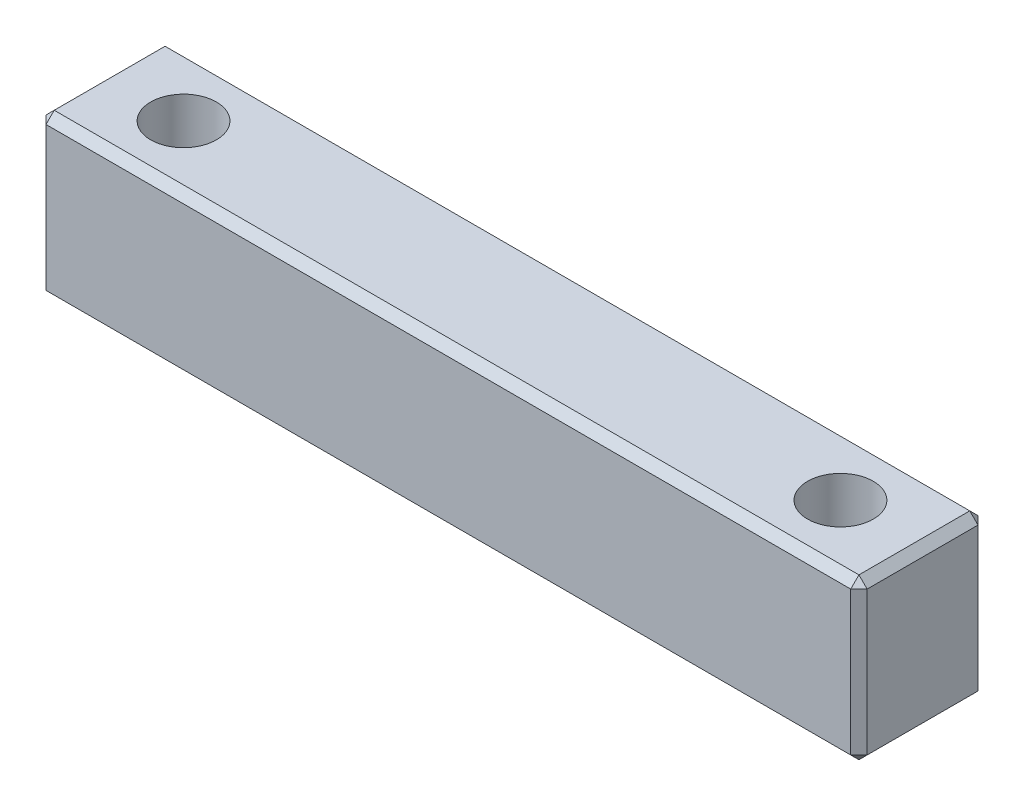
ISO-10303-21;
HEADER;
FILE_DESCRIPTION(('STEP AP214'),'2;1');
FILE_NAME('part.step','',(''),(''),'','','');
FILE_SCHEMA(('AUTOMOTIVE_DESIGN { 1 0 10303 214 1 1 1 1 }'));
ENDSEC;
DATA;
#1=APPLICATION_CONTEXT('core data for automotive mechanical design processes');
#2=APPLICATION_PROTOCOL_DEFINITION('international standard','automotive_design',2000,#1);
#3=PRODUCT_CONTEXT('',#1,'mechanical');
#4=PRODUCT('Part','Part','',(#3));
#5=PRODUCT_RELATED_PRODUCT_CATEGORY('part','',(#4));
#6=PRODUCT_DEFINITION_FORMATION('','',#4);
#7=PRODUCT_DEFINITION_CONTEXT('part definition',#1,'design');
#8=PRODUCT_DEFINITION('design','',#6,#7);
#9=PRODUCT_DEFINITION_SHAPE('','',#8);
#10=(LENGTH_UNIT() NAMED_UNIT(*) SI_UNIT(.MILLI.,.METRE.));
#11=(NAMED_UNIT(*) PLANE_ANGLE_UNIT() SI_UNIT($,.RADIAN.));
#12=(NAMED_UNIT(*) SI_UNIT($,.STERADIAN.) SOLID_ANGLE_UNIT());
#13=UNCERTAINTY_MEASURE_WITH_UNIT(LENGTH_MEASURE(1.E-05),#10,'distance_accuracy_value','');
#14=(GEOMETRIC_REPRESENTATION_CONTEXT(3) GLOBAL_UNCERTAINTY_ASSIGNED_CONTEXT((#13)) GLOBAL_UNIT_ASSIGNED_CONTEXT((#10,
#11,#12)) REPRESENTATION_CONTEXT('',''));
#15=CARTESIAN_POINT('',(0.,0.,0.));
#16=DIRECTION('',(0.,0.,1.));
#17=DIRECTION('',(1.,0.,0.));
#18=AXIS2_PLACEMENT_3D('',#15,#16,#17);
#19=CARTESIAN_POINT('',(50.,0.,0.));
#20=DIRECTION('',(0.,0.,-1.));
#21=DIRECTION('',(0.,1.,0.));
#22=AXIS2_PLACEMENT_3D('',#19,#20,#21);
#23=PLANE('',#22);
#24=DIRECTION('',(0.,1.,0.));
#25=VECTOR('',#24,1.);
#26=CARTESIAN_POINT('',(49.5,0.,0.));
#27=LINE('',#26,#25);
#28=CARTESIAN_POINT('',(49.5,0.5,0.));
#29=VERTEX_POINT('',#28);
#30=CARTESIAN_POINT('',(49.5,9.25,0.));
#31=VERTEX_POINT('',#30);
#32=EDGE_CURVE('E281',#29,#31,#27,.T.);
#33=ORIENTED_EDGE('',*,*,#32,.T.);
#34=DIRECTION('',(-1.,0.,0.));
#35=VECTOR('',#34,1.);
#36=CARTESIAN_POINT('',(50.,9.25,0.));
#37=LINE('',#36,#35);
#38=CARTESIAN_POINT('',(0.5,9.25,0.));
#39=VERTEX_POINT('',#38);
#40=EDGE_CURVE('E290',#31,#39,#37,.T.);
#41=ORIENTED_EDGE('',*,*,#40,.T.);
#42=DIRECTION('',(0.,-1.,0.));
#43=VECTOR('',#42,1.);
#44=CARTESIAN_POINT('',(0.5,0.,0.));
#45=LINE('',#44,#43);
#46=CARTESIAN_POINT('',(0.5,0.5,0.));
#47=VERTEX_POINT('',#46);
#48=EDGE_CURVE('E287',#39,#47,#45,.T.);
#49=ORIENTED_EDGE('',*,*,#48,.T.);
#50=DIRECTION('',(1.,0.,0.));
#51=VECTOR('',#50,1.);
#52=CARTESIAN_POINT('',(50.,0.5,0.));
#53=LINE('',#52,#51);
#54=EDGE_CURVE('E284',#47,#29,#53,.T.);
#55=ORIENTED_EDGE('',*,*,#54,.T.);
#56=EDGE_LOOP('',(#33,#41,#49,#55));
#57=FACE_BOUND('',#56,.T.);
#58=ADVANCED_FACE('F41',(#57),#23,.F.);
#59=CARTESIAN_POINT('',(50.,0.,0.));
#60=DIRECTION('',(0.,1.,0.));
#61=DIRECTION('',(0.,0.,1.));
#62=AXIS2_PLACEMENT_3D('',#59,#60,#61);
#63=PLANE('',#62);
#64=DIRECTION('',(-1.,0.,0.));
#65=VECTOR('',#64,1.);
#66=CARTESIAN_POINT('',(50.,0.,-0.499999999999993));
#67=LINE('',#66,#65);
#68=CARTESIAN_POINT('',(49.5,0.,-0.499999999999993));
#69=VERTEX_POINT('',#68);
#70=CARTESIAN_POINT('',(0.499999999999994,0.,-0.499999999999993));
#71=VERTEX_POINT('',#70);
#72=EDGE_CURVE('E143',#69,#71,#67,.T.);
#73=ORIENTED_EDGE('',*,*,#72,.T.);
#74=DIRECTION('',(0.,0.,-1.));
#75=VECTOR('',#74,1.);
#76=CARTESIAN_POINT('',(0.499999999999994,0.,-7.75000000000001));
#77=LINE('',#76,#75);
#78=CARTESIAN_POINT('',(0.499999999999994,0.,-7.25));
#79=VERTEX_POINT('',#78);
#80=EDGE_CURVE('E138',#71,#79,#77,.T.);
#81=ORIENTED_EDGE('',*,*,#80,.T.);
#82=DIRECTION('',(1.,0.,0.));
#83=VECTOR('',#82,1.);
#84=CARTESIAN_POINT('',(50.,0.,-7.25));
#85=LINE('',#84,#83);
#86=CARTESIAN_POINT('',(49.5,0.,-7.25));
#87=VERTEX_POINT('',#86);
#88=EDGE_CURVE('E131',#79,#87,#85,.T.);
#89=ORIENTED_EDGE('',*,*,#88,.T.);
#90=DIRECTION('',(0.,0.,1.));
#91=VECTOR('',#90,1.);
#92=CARTESIAN_POINT('',(49.5,0.,0.));
#93=LINE('',#92,#91);
#94=EDGE_CURVE('E135',#87,#69,#93,.T.);
#95=ORIENTED_EDGE('',*,*,#94,.T.);
#96=EDGE_LOOP('',(#73,#81,#89,#95));
#97=FACE_BOUND('',#96,.T.);
#98=CARTESIAN_POINT('',(5.,0.,-3.875));
#99=DIRECTION('',(0.,1.,0.));
#100=DIRECTION('',(0.,0.,1.));
#101=AXIS2_PLACEMENT_3D('',#98,#99,#100);
#102=CIRCLE('',#101,2.);
#103=CARTESIAN_POINT('',(5.,0.,-1.875));
#104=VERTEX_POINT('',#103);
#105=EDGE_CURVE('E155',#104,#104,#102,.F.);
#106=ORIENTED_EDGE('',*,*,#105,.F.);
#107=EDGE_LOOP('',(#106));
#108=FACE_BOUND('',#107,.T.);
#109=CARTESIAN_POINT('',(45.,0.,-3.875));
#110=DIRECTION('',(0.,1.,0.));
#111=DIRECTION('',(0.,0.,1.));
#112=AXIS2_PLACEMENT_3D('',#109,#110,#111);
#113=CIRCLE('',#112,2.);
#114=CARTESIAN_POINT('',(45.,0.,-1.875));
#115=VERTEX_POINT('',#114);
#116=EDGE_CURVE('E240',#115,#115,#113,.F.);
#117=ORIENTED_EDGE('',*,*,#116,.F.);
#118=EDGE_LOOP('',(#117));
#119=FACE_BOUND('',#118,.T.);
#120=ADVANCED_FACE('F133',(#97,#108,#119),#63,.F.);
#121=CARTESIAN_POINT('',(50.,0.,-7.75000000000001));
#122=DIRECTION('',(0.,0.,1.));
#123=DIRECTION('',(0.,-1.,0.));
#124=AXIS2_PLACEMENT_3D('',#121,#122,#123);
#125=PLANE('',#124);
#126=DIRECTION('',(0.,-1.,0.));
#127=VECTOR('',#126,1.);
#128=CARTESIAN_POINT('',(49.5,0.,-7.75000000000001));
#129=LINE('',#128,#127);
#130=CARTESIAN_POINT('',(49.5,9.25,-7.75));
#131=VERTEX_POINT('',#130);
#132=CARTESIAN_POINT('',(49.5,0.499999999999994,-7.75000000000001));
#133=VERTEX_POINT('',#132);
#134=EDGE_CURVE('E294',#131,#133,#129,.T.);
#135=ORIENTED_EDGE('',*,*,#134,.T.);
#136=DIRECTION('',(-1.,0.,0.));
#137=VECTOR('',#136,1.);
#138=CARTESIAN_POINT('',(50.,0.499999999999994,-7.75000000000001));
#139=LINE('',#138,#137);
#140=CARTESIAN_POINT('',(0.499999999999994,0.499999999999994,-7.75000000000001));
#141=VERTEX_POINT('',#140);
#142=EDGE_CURVE('E168',#133,#141,#139,.T.);
#143=ORIENTED_EDGE('',*,*,#142,.T.);
#144=DIRECTION('',(0.,1.,0.));
#145=VECTOR('',#144,1.);
#146=CARTESIAN_POINT('',(0.499999999999994,9.75,-7.75));
#147=LINE('',#146,#145);
#148=CARTESIAN_POINT('',(0.499999999999994,9.25,-7.75));
#149=VERTEX_POINT('',#148);
#150=EDGE_CURVE('E300',#141,#149,#147,.T.);
#151=ORIENTED_EDGE('',*,*,#150,.T.);
#152=DIRECTION('',(1.,0.,0.));
#153=VECTOR('',#152,1.);
#154=CARTESIAN_POINT('',(50.,9.25,-7.75));
#155=LINE('',#154,#153);
#156=EDGE_CURVE('E297',#149,#131,#155,.T.);
#157=ORIENTED_EDGE('',*,*,#156,.T.);
#158=EDGE_LOOP('',(#135,#143,#151,#157));
#159=FACE_BOUND('',#158,.T.);
#160=ADVANCED_FACE('F356',(#159),#125,.F.);
#161=CARTESIAN_POINT('',(50.,9.75,0.));
#162=DIRECTION('',(0.,-1.,0.));
#163=DIRECTION('',(0.,0.,-1.));
#164=AXIS2_PLACEMENT_3D('',#161,#162,#163);
#165=PLANE('',#164);
#166=DIRECTION('',(-1.,0.,0.));
#167=VECTOR('',#166,1.);
#168=CARTESIAN_POINT('',(50.,9.75,-7.25));
#169=LINE('',#168,#167);
#170=CARTESIAN_POINT('',(49.5,9.75,-7.25));
#171=VERTEX_POINT('',#170);
#172=CARTESIAN_POINT('',(0.499999999999994,9.75,-7.25));
#173=VERTEX_POINT('',#172);
#174=EDGE_CURVE('E271',#171,#173,#169,.T.);
#175=ORIENTED_EDGE('',*,*,#174,.T.);
#176=DIRECTION('',(0.,0.,1.));
#177=VECTOR('',#176,1.);
#178=CARTESIAN_POINT('',(0.499999999999994,9.75,0.));
#179=LINE('',#178,#177);
#180=CARTESIAN_POINT('',(0.499999999999994,9.75,-0.499999999999987));
#181=VERTEX_POINT('',#180);
#182=EDGE_CURVE('E277',#173,#181,#179,.T.);
#183=ORIENTED_EDGE('',*,*,#182,.T.);
#184=DIRECTION('',(1.,0.,0.));
#185=VECTOR('',#184,1.);
#186=CARTESIAN_POINT('',(50.,9.75,-0.499999999999987));
#187=LINE('',#186,#185);
#188=CARTESIAN_POINT('',(49.5,9.75,-0.499999999999987));
#189=VERTEX_POINT('',#188);
#190=EDGE_CURVE('E274',#181,#189,#187,.T.);
#191=ORIENTED_EDGE('',*,*,#190,.T.);
#192=DIRECTION('',(0.,0.,-1.));
#193=VECTOR('',#192,1.);
#194=CARTESIAN_POINT('',(49.5,9.75,0.));
#195=LINE('',#194,#193);
#196=EDGE_CURVE('E268',#189,#171,#195,.T.);
#197=ORIENTED_EDGE('',*,*,#196,.T.);
#198=EDGE_LOOP('',(#175,#183,#191,#197));
#199=FACE_BOUND('',#198,.T.);
#200=CARTESIAN_POINT('',(5.,9.75,-3.875));
#201=DIRECTION('',(0.,1.,0.));
#202=DIRECTION('',(0.,0.,1.));
#203=AXIS2_PLACEMENT_3D('',#200,#201,#202);
#204=CIRCLE('',#203,2.);
#205=CARTESIAN_POINT('',(5.,9.75,-1.875));
#206=VERTEX_POINT('',#205);
#207=EDGE_CURVE('E246',#206,#206,#204,.T.);
#208=ORIENTED_EDGE('',*,*,#207,.F.);
#209=EDGE_LOOP('',(#208));
#210=FACE_BOUND('',#209,.T.);
#211=CARTESIAN_POINT('',(45.,9.75,-3.875));
#212=DIRECTION('',(0.,1.,0.));
#213=DIRECTION('',(0.,0.,1.));
#214=AXIS2_PLACEMENT_3D('',#211,#212,#213);
#215=CIRCLE('',#214,2.);
#216=CARTESIAN_POINT('',(45.,9.75,-1.875));
#217=VERTEX_POINT('',#216);
#218=EDGE_CURVE('E233',#217,#217,#215,.T.);
#219=ORIENTED_EDGE('',*,*,#218,.F.);
#220=EDGE_LOOP('',(#219));
#221=FACE_BOUND('',#220,.T.);
#222=ADVANCED_FACE('F367',(#199,#210,#221),#165,.F.);
#223=CARTESIAN_POINT('',(50.,0.,0.));
#224=DIRECTION('',(-1.,0.,0.));
#225=DIRECTION('',(0.,0.,1.));
#226=AXIS2_PLACEMENT_3D('',#223,#224,#225);
#227=PLANE('',#226);
#228=DIRECTION('',(0.,1.,0.));
#229=VECTOR('',#228,1.);
#230=CARTESIAN_POINT('',(50.,0.,-7.25000000000001));
#231=LINE('',#230,#229);
#232=CARTESIAN_POINT('',(50.,0.499999999999994,-7.25000000000001));
#233=VERTEX_POINT('',#232);
#234=CARTESIAN_POINT('',(50.,9.25000000000001,-7.25));
#235=VERTEX_POINT('',#234);
#236=EDGE_CURVE('E52',#233,#235,#231,.T.);
#237=ORIENTED_EDGE('',*,*,#236,.T.);
#238=DIRECTION('',(0.,0.,1.));
#239=VECTOR('',#238,1.);
#240=CARTESIAN_POINT('',(50.,9.25000000000001,0.));
#241=LINE('',#240,#239);
#242=CARTESIAN_POINT('',(50.,9.25000000000001,-0.499999999999987));
#243=VERTEX_POINT('',#242);
#244=EDGE_CURVE('E11',#235,#243,#241,.T.);
#245=ORIENTED_EDGE('',*,*,#244,.T.);
#246=DIRECTION('',(0.,-1.,0.));
#247=VECTOR('',#246,1.);
#248=CARTESIAN_POINT('',(50.,0.,-0.499999999999994));
#249=LINE('',#248,#247);
#250=CARTESIAN_POINT('',(50.,0.499999999999994,-0.499999999999993));
#251=VERTEX_POINT('',#250);
#252=EDGE_CURVE('E305',#243,#251,#249,.T.);
#253=ORIENTED_EDGE('',*,*,#252,.T.);
#254=DIRECTION('',(0.,0.,-1.));
#255=VECTOR('',#254,1.);
#256=CARTESIAN_POINT('',(50.,0.499999999999994,0.));
#257=LINE('',#256,#255);
#258=EDGE_CURVE('E63',#251,#233,#257,.T.);
#259=ORIENTED_EDGE('',*,*,#258,.T.);
#260=EDGE_LOOP('',(#237,#245,#253,#259));
#261=FACE_BOUND('',#260,.T.);
#262=ADVANCED_FACE('F381',(#261),#227,.F.);
#263=CARTESIAN_POINT('',(0.,0.,0.));
#264=DIRECTION('',(-1.,0.,0.));
#265=DIRECTION('',(0.,0.,1.));
#266=AXIS2_PLACEMENT_3D('',#263,#264,#265);
#267=PLANE('',#266);
#268=DIRECTION('',(0.,0.,1.));
#269=VECTOR('',#268,1.);
#270=CARTESIAN_POINT('',(0.,0.5,0.));
#271=LINE('',#270,#269);
#272=CARTESIAN_POINT('',(0.,0.5,-7.25));
#273=VERTEX_POINT('',#272);
#274=CARTESIAN_POINT('',(0.,0.5,-0.499999999999993));
#275=VERTEX_POINT('',#274);
#276=EDGE_CURVE('E261',#273,#275,#271,.T.);
#277=ORIENTED_EDGE('',*,*,#276,.T.);
#278=DIRECTION('',(0.,1.,0.));
#279=VECTOR('',#278,1.);
#280=CARTESIAN_POINT('',(0.,9.75,-0.499999999999987));
#281=LINE('',#280,#279);
#282=CARTESIAN_POINT('',(0.,9.25,-0.499999999999987));
#283=VERTEX_POINT('',#282);
#284=EDGE_CURVE('E265',#275,#283,#281,.T.);
#285=ORIENTED_EDGE('',*,*,#284,.T.);
#286=DIRECTION('',(0.,0.,-1.));
#287=VECTOR('',#286,1.);
#288=CARTESIAN_POINT('',(0.,9.25,-7.75));
#289=LINE('',#288,#287);
#290=CARTESIAN_POINT('',(0.,9.25,-7.25));
#291=VERTEX_POINT('',#290);
#292=EDGE_CURVE('E258',#283,#291,#289,.T.);
#293=ORIENTED_EDGE('',*,*,#292,.T.);
#294=DIRECTION('',(0.,-1.,0.));
#295=VECTOR('',#294,1.);
#296=CARTESIAN_POINT('',(0.,0.,-7.25));
#297=LINE('',#296,#295);
#298=EDGE_CURVE('E255',#291,#273,#297,.T.);
#299=ORIENTED_EDGE('',*,*,#298,.T.);
#300=EDGE_LOOP('',(#277,#285,#293,#299));
#301=FACE_BOUND('',#300,.T.);
#302=ADVANCED_FACE('F342',(#301),#267,.T.);
#303=CARTESIAN_POINT('',(45.,-5.65685424949238,-3.875));
#304=DIRECTION('',(0.,1.,0.));
#305=DIRECTION('',(0.,0.,1.));
#306=AXIS2_PLACEMENT_3D('',#303,#304,#305);
#307=CYLINDRICAL_SURFACE('',#306,2.);
#308=ORIENTED_EDGE('',*,*,#116,.T.);
#309=EDGE_LOOP('',(#308));
#310=FACE_BOUND('',#309,.T.);
#311=ORIENTED_EDGE('',*,*,#218,.T.);
#312=EDGE_LOOP('',(#311));
#313=FACE_BOUND('',#312,.T.);
#314=ADVANCED_FACE('F504',(#310,#313),#307,.F.);
#315=CARTESIAN_POINT('',(5.,-5.65685424949238,-3.875));
#316=DIRECTION('',(0.,1.,0.));
#317=DIRECTION('',(0.,0.,1.));
#318=AXIS2_PLACEMENT_3D('',#315,#316,#317);
#319=CYLINDRICAL_SURFACE('',#318,2.);
#320=ORIENTED_EDGE('',*,*,#105,.T.);
#321=EDGE_LOOP('',(#320));
#322=FACE_BOUND('',#321,.T.);
#323=ORIENTED_EDGE('',*,*,#207,.T.);
#324=EDGE_LOOP('',(#323));
#325=FACE_BOUND('',#324,.T.);
#326=ADVANCED_FACE('F500',(#322,#325),#319,.F.);
#327=CARTESIAN_POINT('',(50.,9.25000000000001,0.));
#328=DIRECTION('',(-0.707106781186543,-0.707106781186552,0.));
#329=DIRECTION('',(0.,0.,1.));
#330=AXIS2_PLACEMENT_3D('',#327,#328,#329);
#331=PLANE('',#330);
#332=DIRECTION('',(0.707106781186552,-0.707106781186543,0.));
#333=VECTOR('',#332,1.);
#334=CARTESIAN_POINT('',(49.5,9.75,-0.499999999999987));
#335=LINE('',#334,#333);
#336=EDGE_CURVE('E46',#243,#189,#335,.F.);
#337=ORIENTED_EDGE('',*,*,#336,.F.);
#338=ORIENTED_EDGE('',*,*,#244,.F.);
#339=DIRECTION('',(-0.707106781186552,0.707106781186543,0.));
#340=VECTOR('',#339,1.);
#341=CARTESIAN_POINT('',(49.75,9.5,-7.25));
#342=LINE('',#341,#340);
#343=EDGE_CURVE('E224',#171,#235,#342,.F.);
#344=ORIENTED_EDGE('',*,*,#343,.F.);
#345=ORIENTED_EDGE('',*,*,#196,.F.);
#346=EDGE_LOOP('',(#337,#338,#344,#345));
#347=FACE_BOUND('',#346,.T.);
#348=ADVANCED_FACE('F44',(#347),#331,.F.);
#349=CARTESIAN_POINT('',(49.5,9.75,-0.499999999999987));
#350=DIRECTION('',(0.577350269189618,0.577350269189626,0.577350269189634));
#351=DIRECTION('',(0.,-0.707106781186552,0.707106781186543));
#352=AXIS2_PLACEMENT_3D('',#349,#350,#351);
#353=PLANE('',#352);
#354=DIRECTION('',(-0.707106781186552,0.,0.707106781186543));
#355=VECTOR('',#354,1.);
#356=CARTESIAN_POINT('',(49.75,9.25,-0.24999999999999));
#357=LINE('',#356,#355);
#358=EDGE_CURVE('E217',#243,#31,#357,.T.);
#359=ORIENTED_EDGE('',*,*,#358,.F.);
#360=ORIENTED_EDGE('',*,*,#336,.T.);
#361=DIRECTION('',(0.,0.707106781186552,-0.707106781186543));
#362=VECTOR('',#361,1.);
#363=CARTESIAN_POINT('',(49.5,9.75,-0.499999999999987));
#364=LINE('',#363,#362);
#365=EDGE_CURVE('E221',#31,#189,#364,.T.);
#366=ORIENTED_EDGE('',*,*,#365,.F.);
#367=EDGE_LOOP('',(#359,#360,#366));
#368=FACE_BOUND('',#367,.T.);
#369=ADVANCED_FACE('F492',(#368),#353,.T.);
#370=CARTESIAN_POINT('',(49.5,9.25,-7.75));
#371=DIRECTION('',(0.577350269189618,0.577350269189626,-0.577350269189634));
#372=DIRECTION('',(0.,0.707106781186552,0.707106781186543));
#373=AXIS2_PLACEMENT_3D('',#370,#371,#372);
#374=PLANE('',#373);
#375=DIRECTION('',(0.,-0.707106781186552,-0.707106781186543));
#376=VECTOR('',#375,1.);
#377=CARTESIAN_POINT('',(49.5,9.25,-7.75));
#378=LINE('',#377,#376);
#379=EDGE_CURVE('E209',#171,#131,#378,.T.);
#380=ORIENTED_EDGE('',*,*,#379,.F.);
#381=ORIENTED_EDGE('',*,*,#343,.T.);
#382=DIRECTION('',(0.707106781186552,0.,0.707106781186543));
#383=VECTOR('',#382,1.);
#384=CARTESIAN_POINT('',(49.5,9.25,-7.75));
#385=LINE('',#384,#383);
#386=EDGE_CURVE('E213',#131,#235,#385,.T.);
#387=ORIENTED_EDGE('',*,*,#386,.F.);
#388=EDGE_LOOP('',(#380,#381,#387));
#389=FACE_BOUND('',#388,.T.);
#390=ADVANCED_FACE('F360',(#389),#374,.T.);
#391=CARTESIAN_POINT('',(50.,9.25,0.));
#392=DIRECTION('',(0.,-0.707106781186543,-0.707106781186552));
#393=DIRECTION('',(-1.,0.,0.));
#394=AXIS2_PLACEMENT_3D('',#391,#392,#393);
#395=PLANE('',#394);
#396=ORIENTED_EDGE('',*,*,#365,.T.);
#397=ORIENTED_EDGE('',*,*,#190,.F.);
#398=DIRECTION('',(0.,-0.707106781186552,0.707106781186543));
#399=VECTOR('',#398,1.);
#400=CARTESIAN_POINT('',(0.499999999999994,9.75,-0.499999999999987));
#401=LINE('',#400,#399);
#402=EDGE_CURVE('E202',#39,#181,#401,.F.);
#403=ORIENTED_EDGE('',*,*,#402,.F.);
#404=ORIENTED_EDGE('',*,*,#40,.F.);
#405=EDGE_LOOP('',(#396,#397,#403,#404));
#406=FACE_BOUND('',#405,.T.);
#407=ADVANCED_FACE('F378',(#406),#395,.F.);
#408=CARTESIAN_POINT('',(50.,0.,-0.499999999999994));
#409=DIRECTION('',(-0.707106781186543,0.,-0.707106781186552));
#410=DIRECTION('',(0.,-1.,0.));
#411=AXIS2_PLACEMENT_3D('',#408,#409,#410);
#412=PLANE('',#411);
#413=ORIENTED_EDGE('',*,*,#358,.T.);
#414=ORIENTED_EDGE('',*,*,#32,.F.);
#415=DIRECTION('',(0.707106781186552,0.,-0.707106781186543));
#416=VECTOR('',#415,1.);
#417=CARTESIAN_POINT('',(49.5,0.5,0.));
#418=LINE('',#417,#416);
#419=EDGE_CURVE('E198',#251,#29,#418,.F.);
#420=ORIENTED_EDGE('',*,*,#419,.F.);
#421=ORIENTED_EDGE('',*,*,#252,.F.);
#422=EDGE_LOOP('',(#413,#414,#420,#421));
#423=FACE_BOUND('',#422,.T.);
#424=ADVANCED_FACE('F385',(#423),#412,.F.);
#425=CARTESIAN_POINT('',(50.,0.499999999999994,0.));
#426=DIRECTION('',(-0.707106781186543,0.707106781186552,0.));
#427=DIRECTION('',(0.,0.,-1.));
#428=AXIS2_PLACEMENT_3D('',#425,#426,#427);
#429=PLANE('',#428);
#430=DIRECTION('',(0.707106781186552,0.707106781186543,0.));
#431=VECTOR('',#430,1.);
#432=CARTESIAN_POINT('',(49.5,0.,-7.25));
#433=LINE('',#432,#431);
#434=EDGE_CURVE('E149',#233,#87,#433,.F.);
#435=ORIENTED_EDGE('',*,*,#434,.F.);
#436=ORIENTED_EDGE('',*,*,#258,.F.);
#437=DIRECTION('',(-0.707106781186552,-0.707106781186543,0.));
#438=VECTOR('',#437,1.);
#439=CARTESIAN_POINT('',(49.75,0.249999999999997,-0.499999999999993));
#440=LINE('',#439,#438);
#441=EDGE_CURVE('E152',#69,#251,#440,.F.);
#442=ORIENTED_EDGE('',*,*,#441,.F.);
#443=ORIENTED_EDGE('',*,*,#94,.F.);
#444=EDGE_LOOP('',(#435,#436,#442,#443));
#445=FACE_BOUND('',#444,.T.);
#446=ADVANCED_FACE('F148',(#445),#429,.F.);
#447=CARTESIAN_POINT('',(50.,0.,-7.25000000000001));
#448=DIRECTION('',(-0.707106781186543,0.,0.707106781186552));
#449=DIRECTION('',(0.,1.,0.));
#450=AXIS2_PLACEMENT_3D('',#447,#448,#449);
#451=PLANE('',#450);
#452=ORIENTED_EDGE('',*,*,#386,.T.);
#453=ORIENTED_EDGE('',*,*,#236,.F.);
#454=DIRECTION('',(-0.707106781186552,0.,-0.707106781186543));
#455=VECTOR('',#454,1.);
#456=CARTESIAN_POINT('',(49.75,0.499999999999993,-7.50000000000001));
#457=LINE('',#456,#455);
#458=EDGE_CURVE('E163',#133,#233,#457,.F.);
#459=ORIENTED_EDGE('',*,*,#458,.F.);
#460=ORIENTED_EDGE('',*,*,#134,.F.);
#461=EDGE_LOOP('',(#452,#453,#459,#460));
#462=FACE_BOUND('',#461,.T.);
#463=ADVANCED_FACE('F359',(#462),#451,.F.);
#464=CARTESIAN_POINT('',(50.,9.75,-7.25));
#465=DIRECTION('',(0.,-0.707106781186543,0.707106781186552));
#466=DIRECTION('',(-1.,0.,0.));
#467=AXIS2_PLACEMENT_3D('',#464,#465,#466);
#468=PLANE('',#467);
#469=ORIENTED_EDGE('',*,*,#379,.T.);
#470=ORIENTED_EDGE('',*,*,#156,.F.);
#471=DIRECTION('',(0.,0.707106781186552,0.707106781186543));
#472=VECTOR('',#471,1.);
#473=CARTESIAN_POINT('',(0.499999999999994,9.5,-7.5));
#474=LINE('',#473,#472);
#475=EDGE_CURVE('E190',#173,#149,#474,.F.);
#476=ORIENTED_EDGE('',*,*,#475,.F.);
#477=ORIENTED_EDGE('',*,*,#174,.F.);
#478=EDGE_LOOP('',(#469,#470,#476,#477));
#479=FACE_BOUND('',#478,.T.);
#480=ADVANCED_FACE('F364',(#479),#468,.F.);
#481=CARTESIAN_POINT('',(0.499999999999994,9.75,0.));
#482=DIRECTION('',(-0.707106781186552,0.707106781186543,0.));
#483=DIRECTION('',(0.,0.,-1.));
#484=AXIS2_PLACEMENT_3D('',#481,#482,#483);
#485=PLANE('',#484);
#486=DIRECTION('',(-0.707106781186543,-0.707106781186552,0.));
#487=VECTOR('',#486,1.);
#488=CARTESIAN_POINT('',(0.499999999999994,9.75,-0.499999999999987));
#489=LINE('',#488,#487);
#490=EDGE_CURVE('E205',#181,#283,#489,.T.);
#491=ORIENTED_EDGE('',*,*,#490,.F.);
#492=ORIENTED_EDGE('',*,*,#182,.F.);
#493=DIRECTION('',(0.707106781186543,0.707106781186552,0.));
#494=VECTOR('',#493,1.);
#495=CARTESIAN_POINT('',(0.,9.25,-7.25));
#496=LINE('',#495,#494);
#497=EDGE_CURVE('E186',#291,#173,#496,.T.);
#498=ORIENTED_EDGE('',*,*,#497,.F.);
#499=ORIENTED_EDGE('',*,*,#292,.F.);
#500=EDGE_LOOP('',(#491,#492,#498,#499));
#501=FACE_BOUND('',#500,.T.);
#502=ADVANCED_FACE('F373',(#501),#485,.T.);
#503=CARTESIAN_POINT('',(0.499999999999994,9.75,-0.499999999999987));
#504=DIRECTION('',(-0.577350269189626,0.577350269189618,0.577350269189634));
#505=DIRECTION('',(0.707106781186552,0.,0.707106781186543));
#506=AXIS2_PLACEMENT_3D('',#503,#504,#505);
#507=PLANE('',#506);
#508=ORIENTED_EDGE('',*,*,#402,.T.);
#509=ORIENTED_EDGE('',*,*,#490,.T.);
#510=DIRECTION('',(0.707106781186552,0.,0.707106781186543));
#511=VECTOR('',#510,1.);
#512=CARTESIAN_POINT('',(0.25,9.25,-0.24999999999999));
#513=LINE('',#512,#511);
#514=EDGE_CURVE('E176',#39,#283,#513,.F.);
#515=ORIENTED_EDGE('',*,*,#514,.F.);
#516=EDGE_LOOP('',(#508,#509,#515));
#517=FACE_BOUND('',#516,.T.);
#518=ADVANCED_FACE('F393',(#517),#507,.T.);
#519=CARTESIAN_POINT('',(49.5,0.5,0.));
#520=DIRECTION('',(0.577350269189618,-0.577350269189626,0.577350269189634));
#521=DIRECTION('',(0.,-0.707106781186552,-0.707106781186543));
#522=AXIS2_PLACEMENT_3D('',#519,#520,#521);
#523=PLANE('',#522);
#524=ORIENTED_EDGE('',*,*,#441,.T.);
#525=ORIENTED_EDGE('',*,*,#419,.T.);
#526=DIRECTION('',(0.,0.707106781186552,0.707106781186543));
#527=VECTOR('',#526,1.);
#528=CARTESIAN_POINT('',(49.5,0.5,0.));
#529=LINE('',#528,#527);
#530=EDGE_CURVE('E170',#69,#29,#529,.T.);
#531=ORIENTED_EDGE('',*,*,#530,.F.);
#532=EDGE_LOOP('',(#524,#525,#531));
#533=FACE_BOUND('',#532,.T.);
#534=ADVANCED_FACE('F387',(#533),#523,.T.);
#535=CARTESIAN_POINT('',(49.5,0.,-7.25));
#536=DIRECTION('',(0.577350269189618,-0.577350269189634,-0.577350269189626));
#537=DIRECTION('',(0.,0.707106781186543,-0.707106781186552));
#538=AXIS2_PLACEMENT_3D('',#535,#536,#537);
#539=PLANE('',#538);
#540=ORIENTED_EDGE('',*,*,#458,.T.);
#541=ORIENTED_EDGE('',*,*,#434,.T.);
#542=DIRECTION('',(0.,-0.707106781186543,0.707106781186552));
#543=VECTOR('',#542,1.);
#544=CARTESIAN_POINT('',(49.5,0.,-7.25));
#545=LINE('',#544,#543);
#546=EDGE_CURVE('E160',#133,#87,#545,.T.);
#547=ORIENTED_EDGE('',*,*,#546,.F.);
#548=EDGE_LOOP('',(#540,#541,#547));
#549=FACE_BOUND('',#548,.T.);
#550=ADVANCED_FACE('F159',(#549),#539,.T.);
#551=CARTESIAN_POINT('',(0.,9.25,-7.25));
#552=DIRECTION('',(-0.577350269189634,0.577350269189618,-0.577350269189626));
#553=DIRECTION('',(-0.707106781186543,0.,0.707106781186552));
#554=AXIS2_PLACEMENT_3D('',#551,#552,#553);
#555=PLANE('',#554);
#556=ORIENTED_EDGE('',*,*,#497,.T.);
#557=ORIENTED_EDGE('',*,*,#475,.T.);
#558=DIRECTION('',(-0.707106781186543,0.,0.707106781186552));
#559=VECTOR('',#558,1.);
#560=CARTESIAN_POINT('',(0.,9.25,-7.25));
#561=LINE('',#560,#559);
#562=EDGE_CURVE('E171',#291,#149,#561,.F.);
#563=ORIENTED_EDGE('',*,*,#562,.F.);
#564=EDGE_LOOP('',(#556,#557,#563));
#565=FACE_BOUND('',#564,.T.);
#566=ADVANCED_FACE('F447',(#565),#555,.T.);
#567=CARTESIAN_POINT('',(0.5,0.,0.));
#568=DIRECTION('',(-0.707106781186543,0.,0.707106781186552));
#569=DIRECTION('',(0.,1.,0.));
#570=AXIS2_PLACEMENT_3D('',#567,#568,#569);
#571=PLANE('',#570);
#572=ORIENTED_EDGE('',*,*,#514,.T.);
#573=ORIENTED_EDGE('',*,*,#284,.F.);
#574=DIRECTION('',(-0.707106781186552,0.,-0.707106781186543));
#575=VECTOR('',#574,1.);
#576=CARTESIAN_POINT('',(0.,0.5,-0.499999999999993));
#577=LINE('',#576,#575);
#578=EDGE_CURVE('E179',#47,#275,#577,.T.);
#579=ORIENTED_EDGE('',*,*,#578,.F.);
#580=ORIENTED_EDGE('',*,*,#48,.F.);
#581=EDGE_LOOP('',(#572,#573,#579,#580));
#582=FACE_BOUND('',#581,.T.);
#583=ADVANCED_FACE('F337',(#582),#571,.T.);
#584=CARTESIAN_POINT('',(50.,0.,-0.499999999999993));
#585=DIRECTION('',(0.,0.707106781186543,-0.707106781186552));
#586=DIRECTION('',(-1.,0.,0.));
#587=AXIS2_PLACEMENT_3D('',#584,#585,#586);
#588=PLANE('',#587);
#589=ORIENTED_EDGE('',*,*,#530,.T.);
#590=ORIENTED_EDGE('',*,*,#54,.F.);
#591=DIRECTION('',(0.,-0.707106781186552,-0.707106781186543));
#592=VECTOR('',#591,1.);
#593=CARTESIAN_POINT('',(0.499999999999997,0.25,-0.249999999999996));
#594=LINE('',#593,#592);
#595=EDGE_CURVE('E325',#71,#47,#594,.F.);
#596=ORIENTED_EDGE('',*,*,#595,.F.);
#597=ORIENTED_EDGE('',*,*,#72,.F.);
#598=EDGE_LOOP('',(#589,#590,#596,#597));
#599=FACE_BOUND('',#598,.T.);
#600=ADVANCED_FACE('F391',(#599),#588,.F.);
#601=CARTESIAN_POINT('',(50.,0.499999999999994,-7.75000000000001));
#602=DIRECTION('',(0.,0.707106781186552,0.707106781186543));
#603=DIRECTION('',(-1.,0.,0.));
#604=AXIS2_PLACEMENT_3D('',#601,#602,#603);
#605=PLANE('',#604);
#606=ORIENTED_EDGE('',*,*,#546,.T.);
#607=ORIENTED_EDGE('',*,*,#88,.F.);
#608=DIRECTION('',(0.,0.707106781186543,-0.707106781186552));
#609=VECTOR('',#608,1.);
#610=CARTESIAN_POINT('',(0.499999999999994,0.,-7.25));
#611=LINE('',#610,#609);
#612=EDGE_CURVE('E321',#141,#79,#611,.F.);
#613=ORIENTED_EDGE('',*,*,#612,.F.);
#614=ORIENTED_EDGE('',*,*,#142,.F.);
#615=EDGE_LOOP('',(#606,#607,#613,#614));
#616=FACE_BOUND('',#615,.T.);
#617=ADVANCED_FACE('F166',(#616),#605,.F.);
#618=CARTESIAN_POINT('',(0.499999999999994,0.,-7.75000000000001));
#619=DIRECTION('',(-0.707106781186552,0.,-0.707106781186543));
#620=DIRECTION('',(0.,-1.,0.));
#621=AXIS2_PLACEMENT_3D('',#618,#619,#620);
#622=PLANE('',#621);
#623=ORIENTED_EDGE('',*,*,#562,.T.);
#624=ORIENTED_EDGE('',*,*,#150,.F.);
#625=DIRECTION('',(0.707106781186543,0.,-0.707106781186552));
#626=VECTOR('',#625,1.);
#627=CARTESIAN_POINT('',(0.249999999999997,0.499999999999997,-7.50000000000001));
#628=LINE('',#627,#626);
#629=EDGE_CURVE('E318',#273,#141,#628,.T.);
#630=ORIENTED_EDGE('',*,*,#629,.F.);
#631=ORIENTED_EDGE('',*,*,#298,.F.);
#632=EDGE_LOOP('',(#623,#624,#630,#631));
#633=FACE_BOUND('',#632,.T.);
#634=ADVANCED_FACE('F352',(#633),#622,.T.);
#635=CARTESIAN_POINT('',(0.,0.5,-0.499999999999993));
#636=DIRECTION('',(-0.577350269189626,-0.577350269189618,0.577350269189634));
#637=DIRECTION('',(0.707106781186552,0.,0.707106781186543));
#638=AXIS2_PLACEMENT_3D('',#635,#636,#637);
#639=PLANE('',#638);
#640=ORIENTED_EDGE('',*,*,#595,.T.);
#641=ORIENTED_EDGE('',*,*,#578,.T.);
#642=DIRECTION('',(0.707106781186543,-0.707106781186552,0.));
#643=VECTOR('',#642,1.);
#644=CARTESIAN_POINT('',(0.,0.5,-0.499999999999993));
#645=LINE('',#644,#643);
#646=EDGE_CURVE('E315',#71,#275,#645,.F.);
#647=ORIENTED_EDGE('',*,*,#646,.F.);
#648=EDGE_LOOP('',(#640,#641,#647));
#649=FACE_BOUND('',#648,.T.);
#650=ADVANCED_FACE('F334',(#649),#639,.T.);
#651=CARTESIAN_POINT('',(0.499999999999994,0.,-7.25));
#652=DIRECTION('',(-0.577350269189634,-0.577350269189626,-0.577350269189618));
#653=DIRECTION('',(0.707106781186543,-0.707106781186552,0.));
#654=AXIS2_PLACEMENT_3D('',#651,#652,#653);
#655=PLANE('',#654);
#656=ORIENTED_EDGE('',*,*,#629,.T.);
#657=ORIENTED_EDGE('',*,*,#612,.T.);
#658=DIRECTION('',(-0.707106781186543,0.707106781186552,0.));
#659=VECTOR('',#658,1.);
#660=CARTESIAN_POINT('',(0.499999999999994,0.,-7.25));
#661=LINE('',#660,#659);
#662=EDGE_CURVE('E312',#273,#79,#661,.F.);
#663=ORIENTED_EDGE('',*,*,#662,.F.);
#664=EDGE_LOOP('',(#656,#657,#663));
#665=FACE_BOUND('',#664,.T.);
#666=ADVANCED_FACE('F349',(#665),#655,.T.);
#667=CARTESIAN_POINT('',(0.499999999999994,0.,0.));
#668=DIRECTION('',(-0.707106781186552,-0.707106781186543,0.));
#669=DIRECTION('',(0.,0.,1.));
#670=AXIS2_PLACEMENT_3D('',#667,#668,#669);
#671=PLANE('',#670);
#672=ORIENTED_EDGE('',*,*,#646,.T.);
#673=ORIENTED_EDGE('',*,*,#276,.F.);
#674=ORIENTED_EDGE('',*,*,#662,.T.);
#675=ORIENTED_EDGE('',*,*,#80,.F.);
#676=EDGE_LOOP('',(#672,#673,#674,#675));
#677=FACE_BOUND('',#676,.T.);
#678=ADVANCED_FACE('F347',(#677),#671,.T.);
#679=CLOSED_SHELL('',(#58,#120,#160,#222,#262,#302,#314,#326,#348,#369,#390,#407,#424,#446,#463,
#480,#502,#518,#534,#550,#566,#583,#600,#617,#634,#650,#666,#678));
#680=MANIFOLD_SOLID_BREP('B2',#679);
#681=ADVANCED_BREP_SHAPE_REPRESENTATION('',(#18,#680),#14);
#682=SHAPE_DEFINITION_REPRESENTATION(#9,#681);
ENDSEC;
END-ISO-10303-21;
